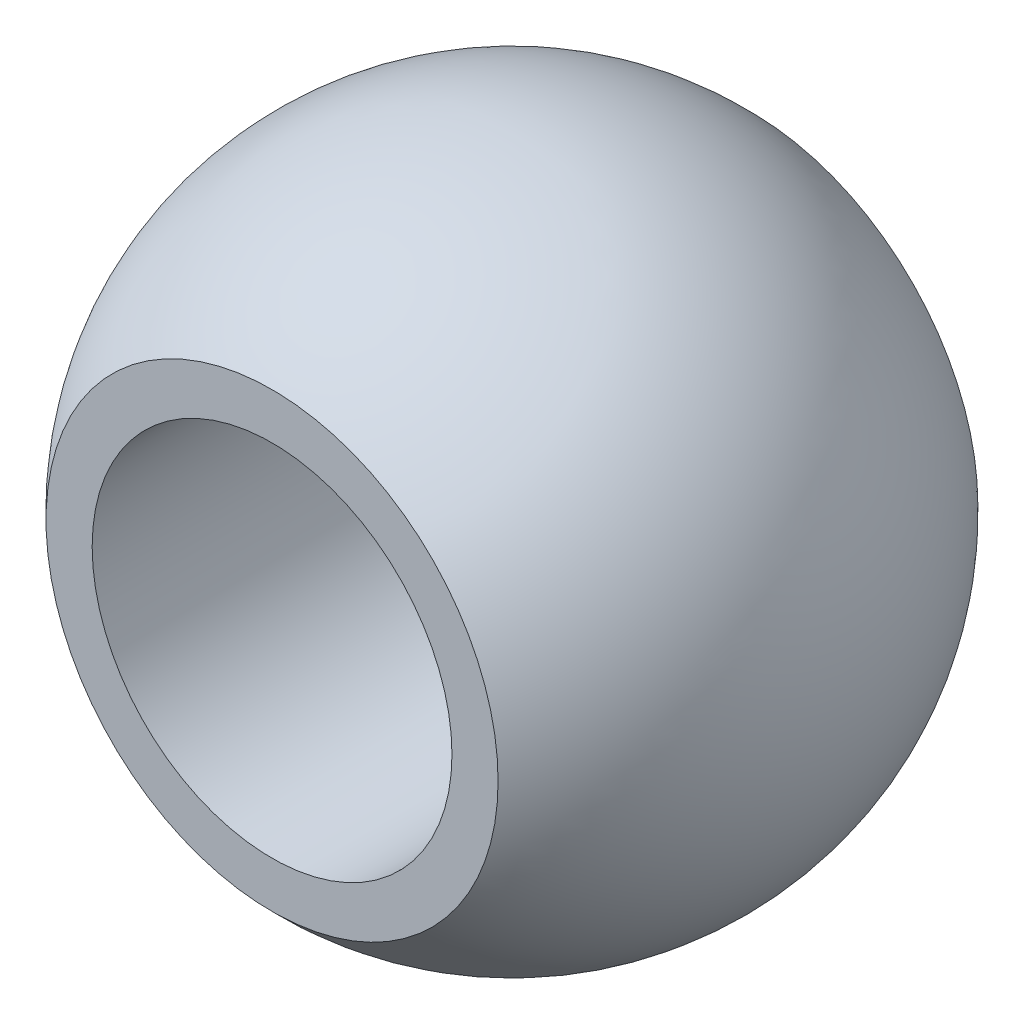
ISO-10303-21;
HEADER;
FILE_DESCRIPTION(('STEP AP214'),'2;1');
FILE_NAME('part.step','',(''),(''),'','','');
FILE_SCHEMA(('AUTOMOTIVE_DESIGN { 1 0 10303 214 1 1 1 1 }'));
ENDSEC;
DATA;
#1=APPLICATION_CONTEXT('core data for automotive mechanical design processes');
#2=APPLICATION_PROTOCOL_DEFINITION('international standard','automotive_design',2000,#1);
#3=PRODUCT_CONTEXT('',#1,'mechanical');
#4=PRODUCT('Part','Part','',(#3));
#5=PRODUCT_RELATED_PRODUCT_CATEGORY('part','',(#4));
#6=PRODUCT_DEFINITION_FORMATION('','',#4);
#7=PRODUCT_DEFINITION_CONTEXT('part definition',#1,'design');
#8=PRODUCT_DEFINITION('design','',#6,#7);
#9=PRODUCT_DEFINITION_SHAPE('','',#8);
#10=(LENGTH_UNIT() NAMED_UNIT(*) SI_UNIT(.MILLI.,.METRE.));
#11=(NAMED_UNIT(*) PLANE_ANGLE_UNIT() SI_UNIT($,.RADIAN.));
#12=(NAMED_UNIT(*) SI_UNIT($,.STERADIAN.) SOLID_ANGLE_UNIT());
#13=UNCERTAINTY_MEASURE_WITH_UNIT(LENGTH_MEASURE(1.E-05),#10,'distance_accuracy_value','');
#14=(GEOMETRIC_REPRESENTATION_CONTEXT(3) GLOBAL_UNCERTAINTY_ASSIGNED_CONTEXT((#13)) GLOBAL_UNIT_ASSIGNED_CONTEXT((#10,
#11,#12)) REPRESENTATION_CONTEXT('',''));
#15=CARTESIAN_POINT('',(0.,0.,0.));
#16=DIRECTION('',(0.,0.,1.));
#17=DIRECTION('',(1.,0.,0.));
#18=AXIS2_PLACEMENT_3D('',#15,#16,#17);
#19=CARTESIAN_POINT('',(0.,0.,0.));
#20=DIRECTION('',(0.,0.,0.999999999999999));
#21=DIRECTION('',(0.,1.,0.));
#22=AXIS2_PLACEMENT_3D('',#19,#20,#21);
#23=SPHERICAL_SURFACE('',#22,8.7249);
#24=CARTESIAN_POINT('',(-1.77635683940025E-12,2.22044604925031E-13,6.35000000000002));
#25=DIRECTION('',(0.,0.,0.999999999999999));
#26=DIRECTION('',(0.999999999999999,0.,0.));
#27=AXIS2_PLACEMENT_3D('',#24,#25,#26);
#28=CIRCLE('',#27,5.98342544116662);
#29=CARTESIAN_POINT('',(5.98342544116484,2.23041045428668E-13,6.35000000000002));
#30=VERTEX_POINT('',#29);
#31=EDGE_CURVE('E52',#30,#30,#28,.T.);
#32=ORIENTED_EDGE('',*,*,#31,.F.);
#33=EDGE_LOOP('',(#32));
#34=FACE_BOUND('',#33,.T.);
#35=CARTESIAN_POINT('',(4.44089209850063E-13,2.22044604925031E-13,-6.34999999999997));
#36=DIRECTION('',(0.,0.,0.999999999999999));
#37=DIRECTION('',(0.999999999999999,0.,0.));
#38=AXIS2_PLACEMENT_3D('',#35,#36,#37);
#39=CIRCLE('',#38,5.98342544116662);
#40=CARTESIAN_POINT('',(5.98342544116706,2.23041045428668E-13,-6.34999999999997));
#41=VERTEX_POINT('',#40);
#42=EDGE_CURVE('E10',#41,#41,#39,.T.);
#43=ORIENTED_EDGE('',*,*,#42,.T.);
#44=EDGE_LOOP('',(#43));
#45=FACE_BOUND('',#44,.T.);
#46=ADVANCED_FACE('F38',(#34,#45),#23,.T.);
#47=CARTESIAN_POINT('',(-8.88178419700125E-13,4.76250000000034,-6.34999999999991));
#48=DIRECTION('',(0.,0.,0.999999999999999));
#49=DIRECTION('',(0.999999999999999,0.,0.));
#50=AXIS2_PLACEMENT_3D('',#47,#48,#49);
#51=PLANE('',#50);
#52=ORIENTED_EDGE('',*,*,#42,.F.);
#53=EDGE_LOOP('',(#52));
#54=FACE_BOUND('',#53,.T.);
#55=CARTESIAN_POINT('',(4.44089209850063E-13,2.22044604925031E-13,-6.34999999999997));
#56=DIRECTION('',(0.,0.,0.999999999999999));
#57=DIRECTION('',(0.999999999999999,0.,0.));
#58=AXIS2_PLACEMENT_3D('',#55,#56,#57);
#59=CIRCLE('',#58,4.7625);
#60=CARTESIAN_POINT('',(4.76250000000044,2.22837720498248E-13,-6.34999999999997));
#61=VERTEX_POINT('',#60);
#62=EDGE_CURVE('E44',#61,#61,#59,.T.);
#63=ORIENTED_EDGE('',*,*,#62,.T.);
#64=EDGE_LOOP('',(#63));
#65=FACE_BOUND('',#64,.T.);
#66=ADVANCED_FACE('F61',(#54,#65),#51,.F.);
#67=CARTESIAN_POINT('',(0.,0.,31.2589553314228));
#68=DIRECTION('',(0.,0.,0.999999999999999));
#69=DIRECTION('',(0.999999999999999,0.,0.));
#70=AXIS2_PLACEMENT_3D('',#67,#68,#69);
#71=CYLINDRICAL_SURFACE('',#70,4.7625);
#72=ORIENTED_EDGE('',*,*,#62,.F.);
#73=EDGE_LOOP('',(#72));
#74=FACE_BOUND('',#73,.T.);
#75=CARTESIAN_POINT('',(-1.77635683940025E-12,2.22044604925031E-13,6.35000000000002));
#76=DIRECTION('',(0.,0.,0.999999999999999));
#77=DIRECTION('',(0.999999999999999,0.,0.));
#78=AXIS2_PLACEMENT_3D('',#75,#76,#77);
#79=CIRCLE('',#78,4.7625);
#80=CARTESIAN_POINT('',(4.76249999999822,2.22837720498248E-13,6.35000000000002));
#81=VERTEX_POINT('',#80);
#82=EDGE_CURVE('E48',#81,#81,#79,.T.);
#83=ORIENTED_EDGE('',*,*,#82,.T.);
#84=EDGE_LOOP('',(#83));
#85=FACE_BOUND('',#84,.T.);
#86=ADVANCED_FACE('F64',(#74,#85),#71,.F.);
#87=CARTESIAN_POINT('',(-8.88178419700125E-13,5.98342544116681,6.35000000000013));
#88=DIRECTION('',(0.,0.,-0.999999999999999));
#89=DIRECTION('',(-0.999999999999999,0.,0.));
#90=AXIS2_PLACEMENT_3D('',#87,#88,#89);
#91=PLANE('',#90);
#92=ORIENTED_EDGE('',*,*,#82,.F.);
#93=EDGE_LOOP('',(#92));
#94=FACE_BOUND('',#93,.T.);
#95=ORIENTED_EDGE('',*,*,#31,.T.);
#96=EDGE_LOOP('',(#95));
#97=FACE_BOUND('',#96,.T.);
#98=ADVANCED_FACE('F58',(#94,#97),#91,.F.);
#99=CLOSED_SHELL('',(#46,#66,#86,#98));
#100=MANIFOLD_SOLID_BREP('B2',#99);
#101=ADVANCED_BREP_SHAPE_REPRESENTATION('',(#18,#100),#14);
#102=SHAPE_DEFINITION_REPRESENTATION(#9,#101);
ENDSEC;
END-ISO-10303-21;
